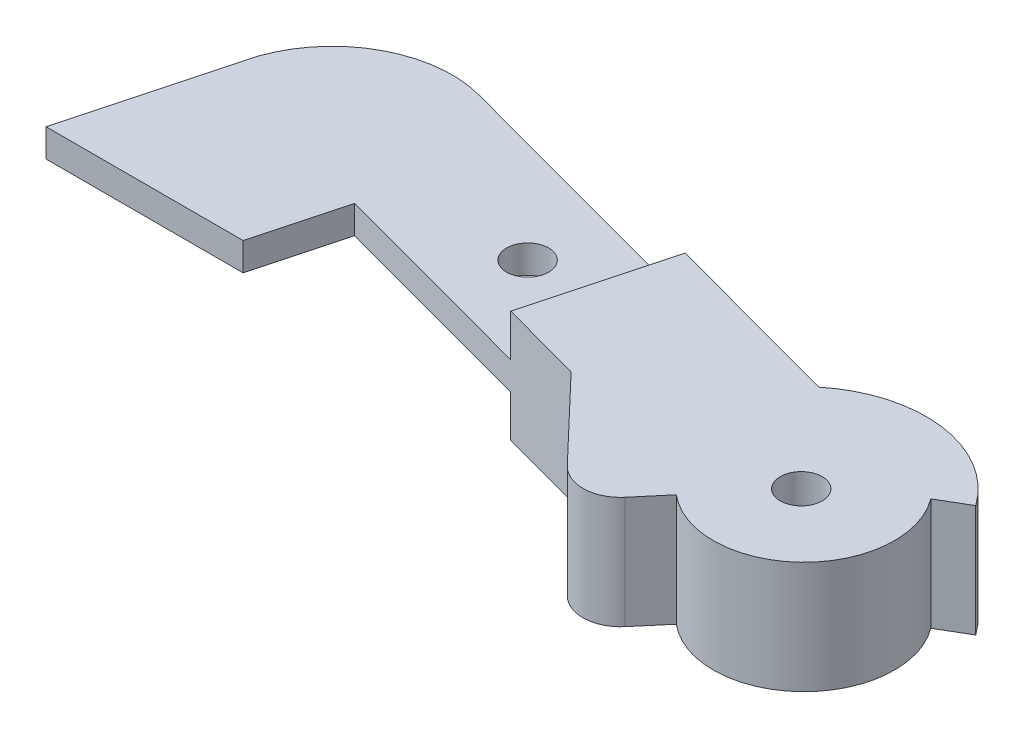
ISO-10303-21;
HEADER;
FILE_DESCRIPTION(('STEP AP214'),'2;1');
FILE_NAME('part.step','',(''),(''),'','','');
FILE_SCHEMA(('AUTOMOTIVE_DESIGN { 1 0 10303 214 1 1 1 1 }'));
ENDSEC;
DATA;
#1=APPLICATION_CONTEXT('core data for automotive mechanical design processes');
#2=APPLICATION_PROTOCOL_DEFINITION('international standard','automotive_design',2000,#1);
#3=PRODUCT_CONTEXT('',#1,'mechanical');
#4=PRODUCT('Part','Part','',(#3));
#5=PRODUCT_RELATED_PRODUCT_CATEGORY('part','',(#4));
#6=PRODUCT_DEFINITION_FORMATION('','',#4);
#7=PRODUCT_DEFINITION_CONTEXT('part definition',#1,'design');
#8=PRODUCT_DEFINITION('design','',#6,#7);
#9=PRODUCT_DEFINITION_SHAPE('','',#8);
#10=(LENGTH_UNIT() NAMED_UNIT(*) SI_UNIT(.MILLI.,.METRE.));
#11=(NAMED_UNIT(*) PLANE_ANGLE_UNIT() SI_UNIT($,.RADIAN.));
#12=(NAMED_UNIT(*) SI_UNIT($,.STERADIAN.) SOLID_ANGLE_UNIT());
#13=UNCERTAINTY_MEASURE_WITH_UNIT(LENGTH_MEASURE(1.E-05),#10,'distance_accuracy_value','');
#14=(GEOMETRIC_REPRESENTATION_CONTEXT(3) GLOBAL_UNCERTAINTY_ASSIGNED_CONTEXT((#13)) GLOBAL_UNIT_ASSIGNED_CONTEXT((#10,
#11,#12)) REPRESENTATION_CONTEXT('',''));
#15=CARTESIAN_POINT('',(0.,0.,0.));
#16=DIRECTION('',(0.,0.,1.));
#17=DIRECTION('',(1.,0.,0.));
#18=AXIS2_PLACEMENT_3D('',#15,#16,#17);
#19=CARTESIAN_POINT('',(0.,3.,0.));
#20=DIRECTION('',(0.,1.,0.));
#21=DIRECTION('',(0.,0.,1.));
#22=AXIS2_PLACEMENT_3D('',#19,#20,#21);
#23=PLANE('',#22);
#24=CARTESIAN_POINT('',(38.1375473411404,3.,-13.414423288289));
#25=DIRECTION('',(0.,1.,0.));
#26=DIRECTION('',(0.,0.,1.));
#27=AXIS2_PLACEMENT_3D('',#24,#25,#26);
#28=CIRCLE('',#27,2.25);
#29=CARTESIAN_POINT('',(38.1375473411404,3.,-11.164423288289));
#30=VERTEX_POINT('',#29);
#31=EDGE_CURVE('E263',#30,#30,#28,.T.);
#32=ORIENTED_EDGE('',*,*,#31,.F.);
#33=EDGE_LOOP('',(#32));
#34=FACE_BOUND('',#33,.T.);
#35=DIRECTION('',(0.965802034417138,0.,0.259280601502922));
#36=VECTOR('',#35,1.);
#37=CARTESIAN_POINT('',(3.94302267334463,3.,-14.6874825867998));
#38=LINE('',#37,#36);
#39=CARTESIAN_POINT('',(23.6218770970386,3.,-9.40446906017879));
#40=VERTEX_POINT('',#39);
#41=CARTESIAN_POINT('',(46.4667869024904,3.,-3.27149175783521));
#42=VERTEX_POINT('',#41);
#43=EDGE_CURVE('E191',#40,#42,#38,.T.);
#44=ORIENTED_EDGE('',*,*,#43,.T.);
#45=DIRECTION('',(0.259777797376157,0.,-0.965668419277752));
#46=VECTOR('',#45,1.);
#47=CARTESIAN_POINT('',(46.4667869024904,3.,-3.27149175783521));
#48=LINE('',#47,#46);
#49=CARTESIAN_POINT('',(50.4273284390443,3.,-17.9939581260828));
#50=VERTEX_POINT('',#49);
#51=EDGE_CURVE('E234',#42,#50,#48,.T.);
#52=ORIENTED_EDGE('',*,*,#51,.T.);
#53=DIRECTION('',(-0.965668419277752,0.,-0.259777797376157));
#54=VECTOR('',#53,1.);
#55=CARTESIAN_POINT('',(7.9170134576932,3.,-29.4298048113059));
#56=LINE('',#55,#54);
#57=CARTESIAN_POINT('',(20.2817959844678,3.,-26.1035119495769));
#58=VERTEX_POINT('',#57);
#59=EDGE_CURVE('E266',#50,#58,#56,.T.);
#60=ORIENTED_EDGE('',*,*,#59,.T.);
#61=CARTESIAN_POINT('',(16.9456022551539,3.,-13.7019250644362));
#62=DIRECTION('',(0.,1.,0.));
#63=DIRECTION('',(0.,0.,1.));
#64=AXIS2_PLACEMENT_3D('',#61,#62,#63);
#65=CIRCLE('',#64,12.8424898625309);
#66=CARTESIAN_POINT('',(4.79412868436272,3.,-17.8577927148279));
#67=VERTEX_POINT('',#66);
#68=EDGE_CURVE('E269',#58,#67,#65,.T.);
#69=ORIENTED_EDGE('',*,*,#68,.T.);
#70=DIRECTION('',(0.259280601502922,0.,-0.965802034417138));
#71=VECTOR('',#70,1.);
#72=CARTESIAN_POINT('',(0.,3.,0.));
#73=LINE('',#72,#71);
#74=CARTESIAN_POINT('',(0.,3.,0.));
#75=VERTEX_POINT('',#74);
#76=EDGE_CURVE('E271',#75,#67,#73,.T.);
#77=ORIENTED_EDGE('',*,*,#76,.F.);
#78=DIRECTION('',(1.,0.,0.));
#79=VECTOR('',#78,1.);
#80=CARTESIAN_POINT('',(0.,3.,0.));
#81=LINE('',#80,#79);
#82=CARTESIAN_POINT('',(21.0971398239282,3.,0.));
#83=VERTEX_POINT('',#82);
#84=EDGE_CURVE('E274',#75,#83,#81,.T.);
#85=ORIENTED_EDGE('',*,*,#84,.T.);
#86=DIRECTION('',(0.259280601502922,0.,-0.965802034417138));
#87=VECTOR('',#86,1.);
#88=CARTESIAN_POINT('',(19.6788544236939,3.,5.28301352662098));
#89=LINE('',#88,#87);
#90=EDGE_CURVE('E276',#83,#40,#89,.T.);
#91=ORIENTED_EDGE('',*,*,#90,.T.);
#92=EDGE_LOOP('',(#44,#52,#60,#69,#77,#85,#91));
#93=FACE_BOUND('',#92,.T.);
#94=ADVANCED_FACE('F65',(#34,#93),#23,.T.);
#95=CARTESIAN_POINT('',(7.9170134576932,3.,-29.4298048113059));
#96=DIRECTION('',(-0.259777797376157,0.,0.965668419277752));
#97=DIRECTION('',(0.965668419277752,0.,0.259777797376157));
#98=AXIS2_PLACEMENT_3D('',#95,#96,#97);
#99=PLANE('',#98);
#100=DIRECTION('',(0.,-1.,0.));
#101=VECTOR('',#100,1.);
#102=CARTESIAN_POINT('',(70.0120906436634,3.,-12.725393589762));
#103=LINE('',#102,#101);
#104=CARTESIAN_POINT('',(70.0120906436634,7.5,-12.725393589762));
#105=VERTEX_POINT('',#104);
#106=CARTESIAN_POINT('',(70.0120906436634,-4.5,-12.725393589762));
#107=VERTEX_POINT('',#106);
#108=EDGE_CURVE('E181',#105,#107,#103,.T.);
#109=ORIENTED_EDGE('',*,*,#108,.T.);
#110=DIRECTION('',(-0.965668419277752,0.,-0.259777797376158));
#111=VECTOR('',#110,1.);
#112=CARTESIAN_POINT('',(7.9170134576932,-4.5,-29.4298048113059));
#113=LINE('',#112,#111);
#114=CARTESIAN_POINT('',(50.4273284390443,-4.5,-17.9939581260828));
#115=VERTEX_POINT('',#114);
#116=EDGE_CURVE('E184',#107,#115,#113,.T.);
#117=ORIENTED_EDGE('',*,*,#116,.T.);
#118=DIRECTION('',(0.,1.,0.));
#119=VECTOR('',#118,1.);
#120=CARTESIAN_POINT('',(50.4273284390443,-4.5,-17.9939581260828));
#121=LINE('',#120,#119);
#122=CARTESIAN_POINT('',(50.4273284390443,0.,-17.9939581260828));
#123=VERTEX_POINT('',#122);
#124=EDGE_CURVE('E227',#115,#123,#121,.T.);
#125=ORIENTED_EDGE('',*,*,#124,.T.);
#126=DIRECTION('',(-0.965668419277752,0.,-0.259777797376157));
#127=VECTOR('',#126,1.);
#128=CARTESIAN_POINT('',(7.9170134576932,0.,-29.4298048113059));
#129=LINE('',#128,#127);
#130=CARTESIAN_POINT('',(20.2817959844678,0.,-26.1035119495769));
#131=VERTEX_POINT('',#130);
#132=EDGE_CURVE('E282',#123,#131,#129,.T.);
#133=ORIENTED_EDGE('',*,*,#132,.T.);
#134=DIRECTION('',(0.,-1.,0.));
#135=VECTOR('',#134,1.);
#136=CARTESIAN_POINT('',(20.2817959844678,3.,-26.1035119495769));
#137=LINE('',#136,#135);
#138=EDGE_CURVE('E12',#58,#131,#137,.T.);
#139=ORIENTED_EDGE('',*,*,#138,.F.);
#140=ORIENTED_EDGE('',*,*,#59,.F.);
#141=DIRECTION('',(0.,-1.,0.));
#142=VECTOR('',#141,1.);
#143=CARTESIAN_POINT('',(50.4273284390443,7.5,-17.9939581260828));
#144=LINE('',#143,#142);
#145=CARTESIAN_POINT('',(50.4273284390443,7.5,-17.9939581260828));
#146=VERTEX_POINT('',#145);
#147=EDGE_CURVE('E88',#146,#50,#144,.T.);
#148=ORIENTED_EDGE('',*,*,#147,.F.);
#149=DIRECTION('',(-0.965668419277752,0.,-0.259777797376158));
#150=VECTOR('',#149,1.);
#151=CARTESIAN_POINT('',(70.0120906436634,7.5,-12.725393589762));
#152=LINE('',#151,#150);
#153=EDGE_CURVE('E185',#105,#146,#152,.T.);
#154=ORIENTED_EDGE('',*,*,#153,.F.);
#155=EDGE_LOOP('',(#109,#117,#125,#133,#139,#140,#148,#154));
#156=FACE_BOUND('',#155,.T.);
#157=ADVANCED_FACE('F183',(#156),#99,.F.);
#158=CARTESIAN_POINT('',(16.9456022551539,3.,-13.7019250644362));
#159=DIRECTION('',(0.,-1.,0.));
#160=DIRECTION('',(0.,0.,-1.));
#161=AXIS2_PLACEMENT_3D('',#158,#159,#160);
#162=CYLINDRICAL_SURFACE('',#161,12.8424898625309);
#163=CARTESIAN_POINT('',(16.9456022551539,0.,-13.7019250644362));
#164=DIRECTION('',(0.,1.,0.));
#165=DIRECTION('',(0.,0.,1.));
#166=AXIS2_PLACEMENT_3D('',#163,#164,#165);
#167=CIRCLE('',#166,12.8424898625309);
#168=CARTESIAN_POINT('',(4.79412868436272,0.,-17.8577927148279));
#169=VERTEX_POINT('',#168);
#170=EDGE_CURVE('E284',#131,#169,#167,.T.);
#171=ORIENTED_EDGE('',*,*,#170,.T.);
#172=DIRECTION('',(0.,-1.,0.));
#173=VECTOR('',#172,1.);
#174=CARTESIAN_POINT('',(4.79412868436272,3.,-17.8577927148279));
#175=LINE('',#174,#173);
#176=EDGE_CURVE('E73',#67,#169,#175,.T.);
#177=ORIENTED_EDGE('',*,*,#176,.F.);
#178=ORIENTED_EDGE('',*,*,#68,.F.);
#179=ORIENTED_EDGE('',*,*,#138,.T.);
#180=EDGE_LOOP('',(#171,#177,#178,#179));
#181=FACE_BOUND('',#180,.T.);
#182=ADVANCED_FACE('F322',(#181),#162,.T.);
#183=CARTESIAN_POINT('',(0.,3.,0.));
#184=DIRECTION('',(-0.965802034417138,0.,-0.259280601502922));
#185=DIRECTION('',(-0.259280601502922,0.,0.965802034417138));
#186=AXIS2_PLACEMENT_3D('',#183,#184,#185);
#187=PLANE('',#186);
#188=DIRECTION('',(0.259280601502922,0.,-0.965802034417138));
#189=VECTOR('',#188,1.);
#190=CARTESIAN_POINT('',(0.,0.,0.));
#191=LINE('',#190,#189);
#192=CARTESIAN_POINT('',(0.,0.,0.));
#193=VERTEX_POINT('',#192);
#194=EDGE_CURVE('E287',#193,#169,#191,.T.);
#195=ORIENTED_EDGE('',*,*,#194,.F.);
#196=DIRECTION('',(0.,-1.,0.));
#197=VECTOR('',#196,1.);
#198=CARTESIAN_POINT('',(0.,3.,0.));
#199=LINE('',#198,#197);
#200=EDGE_CURVE('E313',#75,#193,#199,.T.);
#201=ORIENTED_EDGE('',*,*,#200,.F.);
#202=ORIENTED_EDGE('',*,*,#76,.T.);
#203=ORIENTED_EDGE('',*,*,#176,.T.);
#204=EDGE_LOOP('',(#195,#201,#202,#203));
#205=FACE_BOUND('',#204,.T.);
#206=ADVANCED_FACE('F317',(#205),#187,.T.);
#207=CARTESIAN_POINT('',(0.,3.,0.));
#208=DIRECTION('',(0.,0.,-1.));
#209=DIRECTION('',(-1.,0.,0.));
#210=AXIS2_PLACEMENT_3D('',#207,#208,#209);
#211=PLANE('',#210);
#212=DIRECTION('',(1.,0.,0.));
#213=VECTOR('',#212,1.);
#214=CARTESIAN_POINT('',(0.,0.,0.));
#215=LINE('',#214,#213);
#216=CARTESIAN_POINT('',(21.0971398239282,0.,0.));
#217=VERTEX_POINT('',#216);
#218=EDGE_CURVE('E290',#193,#217,#215,.T.);
#219=ORIENTED_EDGE('',*,*,#218,.T.);
#220=DIRECTION('',(0.,-1.,0.));
#221=VECTOR('',#220,1.);
#222=CARTESIAN_POINT('',(21.0971398239282,3.,0.));
#223=LINE('',#222,#221);
#224=EDGE_CURVE('E310',#83,#217,#223,.T.);
#225=ORIENTED_EDGE('',*,*,#224,.F.);
#226=ORIENTED_EDGE('',*,*,#84,.F.);
#227=ORIENTED_EDGE('',*,*,#200,.T.);
#228=EDGE_LOOP('',(#219,#225,#226,#227));
#229=FACE_BOUND('',#228,.T.);
#230=ADVANCED_FACE('F332',(#229),#211,.F.);
#231=CARTESIAN_POINT('',(19.6788544236939,3.,5.28301352662098));
#232=DIRECTION('',(-0.965802034417138,0.,-0.259280601502922));
#233=DIRECTION('',(-0.259280601502922,0.,0.965802034417138));
#234=AXIS2_PLACEMENT_3D('',#231,#232,#233);
#235=PLANE('',#234);
#236=DIRECTION('',(0.259280601502922,0.,-0.965802034417138));
#237=VECTOR('',#236,1.);
#238=CARTESIAN_POINT('',(19.6788544236939,0.,5.28301352662098));
#239=LINE('',#238,#237);
#240=CARTESIAN_POINT('',(23.6218770970386,0.,-9.40446906017879));
#241=VERTEX_POINT('',#240);
#242=EDGE_CURVE('E292',#217,#241,#239,.T.);
#243=ORIENTED_EDGE('',*,*,#242,.T.);
#244=DIRECTION('',(0.,-1.,0.));
#245=VECTOR('',#244,1.);
#246=CARTESIAN_POINT('',(23.6218770970386,3.,-9.40446906017879));
#247=LINE('',#246,#245);
#248=EDGE_CURVE('E307',#40,#241,#247,.T.);
#249=ORIENTED_EDGE('',*,*,#248,.F.);
#250=ORIENTED_EDGE('',*,*,#90,.F.);
#251=ORIENTED_EDGE('',*,*,#224,.T.);
#252=EDGE_LOOP('',(#243,#249,#250,#251));
#253=FACE_BOUND('',#252,.T.);
#254=ADVANCED_FACE('F336',(#253),#235,.F.);
#255=CARTESIAN_POINT('',(3.94302267334463,3.,-14.6874825867998));
#256=DIRECTION('',(0.259280601502922,0.,-0.965802034417138));
#257=DIRECTION('',(-0.965802034417138,0.,-0.259280601502922));
#258=AXIS2_PLACEMENT_3D('',#255,#256,#257);
#259=PLANE('',#258);
#260=DIRECTION('',(0.965802034417138,0.,0.259280601502922));
#261=VECTOR('',#260,1.);
#262=CARTESIAN_POINT('',(3.94302267334463,0.,-14.6874825867998));
#263=LINE('',#262,#261);
#264=CARTESIAN_POINT('',(46.4667869024904,0.,-3.27149175783521));
#265=VERTEX_POINT('',#264);
#266=EDGE_CURVE('E267',#241,#265,#263,.T.);
#267=ORIENTED_EDGE('',*,*,#266,.T.);
#268=DIRECTION('',(0.,1.,0.));
#269=VECTOR('',#268,1.);
#270=CARTESIAN_POINT('',(46.4667869024904,-4.5,-3.27149175783521));
#271=LINE('',#270,#269);
#272=CARTESIAN_POINT('',(46.4667869024904,-4.5,-3.27149175783521));
#273=VERTEX_POINT('',#272);
#274=EDGE_CURVE('E80',#273,#265,#271,.T.);
#275=ORIENTED_EDGE('',*,*,#274,.F.);
#276=DIRECTION('',(0.965802034417138,0.,0.259280601502922));
#277=VECTOR('',#276,1.);
#278=CARTESIAN_POINT('',(3.94302267334463,-4.5,-14.6874825867998));
#279=LINE('',#278,#277);
#280=CARTESIAN_POINT('',(55.3156360705464,-4.5,-0.895916999094068));
#281=VERTEX_POINT('',#280);
#282=EDGE_CURVE('E211',#273,#281,#279,.T.);
#283=ORIENTED_EDGE('',*,*,#282,.T.);
#284=DIRECTION('',(0.,-1.,0.));
#285=VECTOR('',#284,1.);
#286=CARTESIAN_POINT('',(55.3156360705464,3.,-0.895916999094084));
#287=LINE('',#286,#285);
#288=CARTESIAN_POINT('',(55.3156360705464,7.5,-0.895916999094082));
#289=VERTEX_POINT('',#288);
#290=EDGE_CURVE('E305',#289,#281,#287,.T.);
#291=ORIENTED_EDGE('',*,*,#290,.F.);
#292=DIRECTION('',(0.965802034417138,0.,0.259280601502922));
#293=VECTOR('',#292,1.);
#294=CARTESIAN_POINT('',(46.4667869024904,7.5,-3.27149175783521));
#295=LINE('',#294,#293);
#296=CARTESIAN_POINT('',(46.4667869024904,7.5,-3.27149175783521));
#297=VERTEX_POINT('',#296);
#298=EDGE_CURVE('E255',#297,#289,#295,.T.);
#299=ORIENTED_EDGE('',*,*,#298,.F.);
#300=DIRECTION('',(0.,-1.,0.));
#301=VECTOR('',#300,1.);
#302=CARTESIAN_POINT('',(46.4667869024904,7.5,-3.27149175783521));
#303=LINE('',#302,#301);
#304=EDGE_CURVE('E259',#297,#42,#303,.T.);
#305=ORIENTED_EDGE('',*,*,#304,.T.);
#306=ORIENTED_EDGE('',*,*,#43,.F.);
#307=ORIENTED_EDGE('',*,*,#248,.T.);
#308=EDGE_LOOP('',(#267,#275,#283,#291,#299,#305,#306,#307));
#309=FACE_BOUND('',#308,.T.);
#310=ADVANCED_FACE('F342',(#309),#259,.F.);
#311=CARTESIAN_POINT('',(29.4129100361565,3.,-28.0536683683049));
#312=DIRECTION('',(0.72362939989931,0.,-0.690188736217394));
#313=DIRECTION('',(-0.690188736217394,0.,-0.72362939989931));
#314=AXIS2_PLACEMENT_3D('',#311,#312,#313);
#315=PLANE('',#314);
#316=ORIENTED_EDGE('',*,*,#290,.T.);
#317=DIRECTION('',(0.690188736217395,0.,0.72362939989931));
#318=VECTOR('',#317,1.);
#319=CARTESIAN_POINT('',(29.4129100361564,-4.5,-28.0536683683049));
#320=LINE('',#319,#318);
#321=CARTESIAN_POINT('',(63.8376796319956,-4.5,8.03903216000791));
#322=VERTEX_POINT('',#321);
#323=EDGE_CURVE('E214',#281,#322,#320,.T.);
#324=ORIENTED_EDGE('',*,*,#323,.T.);
#325=DIRECTION('',(0.,-1.,0.));
#326=VECTOR('',#325,1.);
#327=CARTESIAN_POINT('',(63.8376796319956,3.,8.0390321600079));
#328=LINE('',#327,#326);
#329=CARTESIAN_POINT('',(63.8376796319956,7.5,8.0390321600079));
#330=VERTEX_POINT('',#329);
#331=EDGE_CURVE('E303',#330,#322,#328,.T.);
#332=ORIENTED_EDGE('',*,*,#331,.F.);
#333=DIRECTION('',(0.690188736217395,0.,0.72362939989931));
#334=VECTOR('',#333,1.);
#335=CARTESIAN_POINT('',(55.3156360705464,7.5,-0.895916999094082));
#336=LINE('',#335,#334);
#337=EDGE_CURVE('E252',#289,#330,#336,.T.);
#338=ORIENTED_EDGE('',*,*,#337,.F.);
#339=EDGE_LOOP('',(#316,#324,#332,#338));
#340=FACE_BOUND('',#339,.T.);
#341=ADVANCED_FACE('F387',(#340),#315,.F.);
#342=CARTESIAN_POINT('',(66.757905074769,3.,5.25375739353469));
#343=DIRECTION('',(0.,-1.,0.));
#344=DIRECTION('',(0.,0.,-1.));
#345=AXIS2_PLACEMENT_3D('',#342,#343,#344);
#346=CYLINDRICAL_SURFACE('',#345,4.03552625581521);
#347=ORIENTED_EDGE('',*,*,#331,.T.);
#348=CARTESIAN_POINT('',(66.757905074769,-4.5,5.25375739353469));
#349=DIRECTION('',(0.,1.,0.));
#350=DIRECTION('',(0.,0.,1.));
#351=AXIS2_PLACEMENT_3D('',#348,#349,#350);
#352=CIRCLE('',#351,4.03552625581521);
#353=CARTESIAN_POINT('',(69.8379967156942,-4.5,7.86115219388176));
#354=VERTEX_POINT('',#353);
#355=EDGE_CURVE('E217',#322,#354,#352,.T.);
#356=ORIENTED_EDGE('',*,*,#355,.T.);
#357=DIRECTION('',(0.,-1.,0.));
#358=VECTOR('',#357,1.);
#359=CARTESIAN_POINT('',(69.8379967156942,3.,7.86115219388177));
#360=LINE('',#359,#358);
#361=CARTESIAN_POINT('',(69.8379967156942,7.5,7.86115219388176));
#362=VERTEX_POINT('',#361);
#363=EDGE_CURVE('E301',#362,#354,#360,.T.);
#364=ORIENTED_EDGE('',*,*,#363,.F.);
#365=CARTESIAN_POINT('',(66.757905074769,7.5,5.25375739353469));
#366=DIRECTION('',(0.,1.,0.));
#367=DIRECTION('',(0.,0.,1.));
#368=AXIS2_PLACEMENT_3D('',#365,#366,#367);
#369=CIRCLE('',#368,4.03552625581521);
#370=EDGE_CURVE('E249',#330,#362,#369,.T.);
#371=ORIENTED_EDGE('',*,*,#370,.F.);
#372=EDGE_LOOP('',(#347,#356,#364,#371));
#373=FACE_BOUND('',#372,.T.);
#374=ADVANCED_FACE('F383',(#373),#346,.T.);
#375=CARTESIAN_POINT('',(44.5601834680311,3.,37.7216018943377));
#376=DIRECTION('',(0.763244108866031,0.,0.646110230751146));
#377=DIRECTION('',(0.646110230751146,0.,-0.763244108866031));
#378=AXIS2_PLACEMENT_3D('',#375,#376,#377);
#379=PLANE('',#378);
#380=ORIENTED_EDGE('',*,*,#363,.T.);
#381=DIRECTION('',(0.646110230751145,0.,-0.763244108866031));
#382=VECTOR('',#381,1.);
#383=CARTESIAN_POINT('',(44.5601834680311,-4.5,37.7216018943377));
#384=LINE('',#383,#382);
#385=CARTESIAN_POINT('',(72.3541391992329,-4.5,4.8888560805764));
#386=VERTEX_POINT('',#385);
#387=EDGE_CURVE('E220',#354,#386,#384,.T.);
#388=ORIENTED_EDGE('',*,*,#387,.T.);
#389=DIRECTION('',(0.,-1.,0.));
#390=VECTOR('',#389,1.);
#391=CARTESIAN_POINT('',(72.3541391992329,3.,4.8888560805764));
#392=LINE('',#391,#390);
#393=CARTESIAN_POINT('',(72.3541391992329,7.5,4.8888560805764));
#394=VERTEX_POINT('',#393);
#395=EDGE_CURVE('E299',#394,#386,#392,.T.);
#396=ORIENTED_EDGE('',*,*,#395,.F.);
#397=DIRECTION('',(-0.646110230751145,0.,0.763244108866031));
#398=VECTOR('',#397,1.);
#399=CARTESIAN_POINT('',(72.3541391992329,7.5,4.8888560805764));
#400=LINE('',#399,#398);
#401=EDGE_CURVE('E246',#394,#362,#400,.T.);
#402=ORIENTED_EDGE('',*,*,#401,.T.);
#403=EDGE_LOOP('',(#380,#388,#396,#402));
#404=FACE_BOUND('',#403,.T.);
#405=ADVANCED_FACE('F379',(#404),#379,.T.);
#406=CARTESIAN_POINT('',(78.5875808392102,3.,-2.54414840176175));
#407=DIRECTION('',(0.,-1.,0.));
#408=DIRECTION('',(0.,0.,-1.));
#409=AXIS2_PLACEMENT_3D('',#406,#407,#408);
#410=CYLINDRICAL_SURFACE('',#409,9.70079122100164);
#411=ORIENTED_EDGE('',*,*,#395,.T.);
#412=CARTESIAN_POINT('',(78.5875808392102,-4.5,-2.54414840176176));
#413=DIRECTION('',(0.,1.,0.));
#414=DIRECTION('',(0.,0.,1.));
#415=AXIS2_PLACEMENT_3D('',#412,#413,#414);
#416=CIRCLE('',#415,9.70079122100164);
#417=CARTESIAN_POINT('',(86.3532864945731,-4.5,-8.3578534155828));
#418=VERTEX_POINT('',#417);
#419=EDGE_CURVE('E223',#386,#418,#416,.T.);
#420=ORIENTED_EDGE('',*,*,#419,.T.);
#421=DIRECTION('',(0.,-1.,0.));
#422=VECTOR('',#421,1.);
#423=CARTESIAN_POINT('',(86.3532864945731,3.,-8.3578534155828));
#424=LINE('',#423,#422);
#425=CARTESIAN_POINT('',(86.3532864945731,7.5,-8.3578534155828));
#426=VERTEX_POINT('',#425);
#427=EDGE_CURVE('E297',#426,#418,#424,.T.);
#428=ORIENTED_EDGE('',*,*,#427,.F.);
#429=CARTESIAN_POINT('',(78.5875808392102,7.5,-2.54414840176176));
#430=DIRECTION('',(0.,1.,0.));
#431=DIRECTION('',(0.,0.,1.));
#432=AXIS2_PLACEMENT_3D('',#429,#430,#431);
#433=CIRCLE('',#432,9.70079122100164);
#434=EDGE_CURVE('E243',#394,#426,#433,.T.);
#435=ORIENTED_EDGE('',*,*,#434,.F.);
#436=EDGE_LOOP('',(#411,#420,#428,#435));
#437=FACE_BOUND('',#436,.T.);
#438=ADVANCED_FACE('F375',(#437),#410,.T.);
#439=CARTESIAN_POINT('',(18.453197851153,3.,31.4642661665422));
#440=DIRECTION('',(0.505895532026137,0.,0.862594754607279));
#441=DIRECTION('',(0.862594754607279,0.,-0.505895532026137));
#442=AXIS2_PLACEMENT_3D('',#439,#440,#441);
#443=PLANE('',#442);
#444=ORIENTED_EDGE('',*,*,#427,.T.);
#445=DIRECTION('',(0.862594754607279,0.,-0.505895532026138));
#446=VECTOR('',#445,1.);
#447=CARTESIAN_POINT('',(18.4531978511531,-4.5,31.4642661665423));
#448=LINE('',#447,#446);
#449=CARTESIAN_POINT('',(89.3835009315383,-4.5,-10.1350169521727));
#450=VERTEX_POINT('',#449);
#451=EDGE_CURVE('E226',#418,#450,#448,.T.);
#452=ORIENTED_EDGE('',*,*,#451,.T.);
#453=DIRECTION('',(0.,-1.,0.));
#454=VECTOR('',#453,1.);
#455=CARTESIAN_POINT('',(89.3835009315383,3.,-10.1350169521727));
#456=LINE('',#455,#454);
#457=CARTESIAN_POINT('',(89.3835009315383,7.5,-10.1350169521727));
#458=VERTEX_POINT('',#457);
#459=EDGE_CURVE('E190',#458,#450,#456,.T.);
#460=ORIENTED_EDGE('',*,*,#459,.F.);
#461=DIRECTION('',(-0.862594754607279,0.,0.505895532026138));
#462=VECTOR('',#461,1.);
#463=CARTESIAN_POINT('',(89.3835009315383,7.5,-10.1350169521727));
#464=LINE('',#463,#462);
#465=EDGE_CURVE('E240',#458,#426,#464,.T.);
#466=ORIENTED_EDGE('',*,*,#465,.T.);
#467=EDGE_LOOP('',(#444,#452,#460,#466));
#468=FACE_BOUND('',#467,.T.);
#469=ADVANCED_FACE('F371',(#468),#443,.T.);
#470=CARTESIAN_POINT('',(78.4844476153933,3.,-2.3565188715452));
#471=DIRECTION('',(0.,-1.,0.));
#472=DIRECTION('',(0.,0.,-1.));
#473=AXIS2_PLACEMENT_3D('',#470,#471,#472);
#474=CYLINDRICAL_SURFACE('',#473,2.25);
#475=CARTESIAN_POINT('',(78.4844476153933,7.5,-2.3565188715452));
#476=DIRECTION('',(0.,1.,0.));
#477=DIRECTION('',(0.,0.,1.));
#478=AXIS2_PLACEMENT_3D('',#475,#476,#477);
#479=CIRCLE('',#478,2.25);
#480=CARTESIAN_POINT('',(78.4844476153933,7.5,-0.106518871545203));
#481=VERTEX_POINT('',#480);
#482=EDGE_CURVE('E230',#481,#481,#479,.T.);
#483=ORIENTED_EDGE('',*,*,#482,.T.);
#484=EDGE_LOOP('',(#483));
#485=FACE_BOUND('',#484,.T.);
#486=CARTESIAN_POINT('',(78.4844476153933,-4.5,-2.3565188715452));
#487=DIRECTION('',(0.,1.,0.));
#488=DIRECTION('',(0.,0.,1.));
#489=AXIS2_PLACEMENT_3D('',#486,#487,#488);
#490=CIRCLE('',#489,2.25);
#491=CARTESIAN_POINT('',(78.4844476153933,-4.5,-0.106518871545203));
#492=VERTEX_POINT('',#491);
#493=EDGE_CURVE('E206',#492,#492,#490,.T.);
#494=ORIENTED_EDGE('',*,*,#493,.F.);
#495=EDGE_LOOP('',(#494));
#496=FACE_BOUND('',#495,.T.);
#497=ADVANCED_FACE('F374',(#485,#496),#474,.F.);
#498=CARTESIAN_POINT('',(38.1375473411404,3.,-13.414423288289));
#499=DIRECTION('',(0.,-1.,0.));
#500=DIRECTION('',(0.,0.,-1.));
#501=AXIS2_PLACEMENT_3D('',#498,#499,#500);
#502=CYLINDRICAL_SURFACE('',#501,2.25);
#503=ORIENTED_EDGE('',*,*,#31,.T.);
#504=EDGE_LOOP('',(#503));
#505=FACE_BOUND('',#504,.T.);
#506=CARTESIAN_POINT('',(38.1375473411404,0.,-13.414423288289));
#507=DIRECTION('',(0.,1.,0.));
#508=DIRECTION('',(0.,0.,1.));
#509=AXIS2_PLACEMENT_3D('',#506,#507,#508);
#510=CIRCLE('',#509,2.25);
#511=CARTESIAN_POINT('',(38.1375473411404,0.,-11.164423288289));
#512=VERTEX_POINT('',#511);
#513=EDGE_CURVE('E261',#512,#512,#510,.T.);
#514=ORIENTED_EDGE('',*,*,#513,.F.);
#515=EDGE_LOOP('',(#514));
#516=FACE_BOUND('',#515,.T.);
#517=ADVANCED_FACE('F67',(#505,#516),#502,.F.);
#518=CARTESIAN_POINT('',(78.4844476153933,3.,-2.3565188715452));
#519=DIRECTION('',(0.,-1.,0.));
#520=DIRECTION('',(0.,0.,-1.));
#521=AXIS2_PLACEMENT_3D('',#518,#519,#520);
#522=CYLINDRICAL_SURFACE('',#521,13.3900857196097);
#523=ORIENTED_EDGE('',*,*,#459,.T.);
#524=CARTESIAN_POINT('',(78.4844476153933,-4.5,-2.3565188715452));
#525=DIRECTION('',(0.,1.,0.));
#526=DIRECTION('',(0.,0.,1.));
#527=AXIS2_PLACEMENT_3D('',#524,#525,#526);
#528=CIRCLE('',#527,13.3900857196097);
#529=EDGE_CURVE('E198',#450,#107,#528,.T.);
#530=ORIENTED_EDGE('',*,*,#529,.T.);
#531=ORIENTED_EDGE('',*,*,#108,.F.);
#532=CARTESIAN_POINT('',(78.4844476153933,7.5,-2.3565188715452));
#533=DIRECTION('',(0.,1.,0.));
#534=DIRECTION('',(0.,0.,1.));
#535=AXIS2_PLACEMENT_3D('',#532,#533,#534);
#536=CIRCLE('',#535,13.3900857196097);
#537=EDGE_CURVE('E238',#458,#105,#536,.T.);
#538=ORIENTED_EDGE('',*,*,#537,.F.);
#539=EDGE_LOOP('',(#523,#530,#531,#538));
#540=FACE_BOUND('',#539,.T.);
#541=ADVANCED_FACE('F203',(#540),#522,.T.);
#542=CARTESIAN_POINT('',(0.,0.,0.));
#543=DIRECTION('',(0.,1.,0.));
#544=DIRECTION('',(0.,0.,1.));
#545=AXIS2_PLACEMENT_3D('',#542,#543,#544);
#546=PLANE('',#545);
#547=ORIENTED_EDGE('',*,*,#513,.T.);
#548=EDGE_LOOP('',(#547));
#549=FACE_BOUND('',#548,.T.);
#550=ORIENTED_EDGE('',*,*,#132,.F.);
#551=DIRECTION('',(-0.259777797376157,0.,0.965668419277752));
#552=VECTOR('',#551,1.);
#553=CARTESIAN_POINT('',(42.5103149813511,0.,11.4358466852231));
#554=LINE('',#553,#552);
#555=EDGE_CURVE('E204',#123,#265,#554,.T.);
#556=ORIENTED_EDGE('',*,*,#555,.T.);
#557=ORIENTED_EDGE('',*,*,#266,.F.);
#558=ORIENTED_EDGE('',*,*,#242,.F.);
#559=ORIENTED_EDGE('',*,*,#218,.F.);
#560=ORIENTED_EDGE('',*,*,#194,.T.);
#561=ORIENTED_EDGE('',*,*,#170,.F.);
#562=EDGE_LOOP('',(#550,#556,#557,#558,#559,#560,#561));
#563=FACE_BOUND('',#562,.T.);
#564=ADVANCED_FACE('F327',(#549,#563),#546,.F.);
#565=CARTESIAN_POINT('',(78.4844476153933,7.5,-2.3565188715452));
#566=DIRECTION('',(0.,1.,0.));
#567=DIRECTION('',(0.,0.,1.));
#568=AXIS2_PLACEMENT_3D('',#565,#566,#567);
#569=PLANE('',#568);
#570=DIRECTION('',(0.259777797376157,0.,-0.965668419277752));
#571=VECTOR('',#570,1.);
#572=CARTESIAN_POINT('',(46.4667869024904,7.5,-3.27149175783521));
#573=LINE('',#572,#571);
#574=EDGE_CURVE('E235',#297,#146,#573,.T.);
#575=ORIENTED_EDGE('',*,*,#574,.F.);
#576=ORIENTED_EDGE('',*,*,#298,.T.);
#577=ORIENTED_EDGE('',*,*,#337,.T.);
#578=ORIENTED_EDGE('',*,*,#370,.T.);
#579=ORIENTED_EDGE('',*,*,#401,.F.);
#580=ORIENTED_EDGE('',*,*,#434,.T.);
#581=ORIENTED_EDGE('',*,*,#465,.F.);
#582=ORIENTED_EDGE('',*,*,#537,.T.);
#583=ORIENTED_EDGE('',*,*,#153,.T.);
#584=EDGE_LOOP('',(#575,#576,#577,#578,#579,#580,#581,#582,#583));
#585=FACE_BOUND('',#584,.T.);
#586=ORIENTED_EDGE('',*,*,#482,.F.);
#587=EDGE_LOOP('',(#586));
#588=FACE_BOUND('',#587,.T.);
#589=ADVANCED_FACE('F348',(#585,#588),#569,.T.);
#590=CARTESIAN_POINT('',(46.4667869024904,7.5,-3.27149175783521));
#591=DIRECTION('',(-0.965668419277752,0.,-0.259777797376157));
#592=DIRECTION('',(-0.259777797376157,0.,0.965668419277752));
#593=AXIS2_PLACEMENT_3D('',#590,#591,#592);
#594=PLANE('',#593);
#595=ORIENTED_EDGE('',*,*,#51,.F.);
#596=ORIENTED_EDGE('',*,*,#304,.F.);
#597=ORIENTED_EDGE('',*,*,#574,.T.);
#598=ORIENTED_EDGE('',*,*,#147,.T.);
#599=EDGE_LOOP('',(#595,#596,#597,#598));
#600=FACE_BOUND('',#599,.T.);
#601=ADVANCED_FACE('F345',(#600),#594,.T.);
#602=CARTESIAN_POINT('',(42.5103149813511,-4.5,11.4358466852231));
#603=DIRECTION('',(-0.965668419277752,0.,-0.259777797376157));
#604=DIRECTION('',(-0.259777797376157,0.,0.965668419277752));
#605=AXIS2_PLACEMENT_3D('',#602,#603,#604);
#606=PLANE('',#605);
#607=ORIENTED_EDGE('',*,*,#555,.F.);
#608=ORIENTED_EDGE('',*,*,#124,.F.);
#609=DIRECTION('',(-0.259777797376157,0.,0.965668419277752));
#610=VECTOR('',#609,1.);
#611=CARTESIAN_POINT('',(42.5103149813511,-4.5,11.4358466852231));
#612=LINE('',#611,#610);
#613=EDGE_CURVE('E201',#115,#273,#612,.T.);
#614=ORIENTED_EDGE('',*,*,#613,.T.);
#615=ORIENTED_EDGE('',*,*,#274,.T.);
#616=EDGE_LOOP('',(#607,#608,#614,#615));
#617=FACE_BOUND('',#616,.T.);
#618=ADVANCED_FACE('F347',(#617),#606,.T.);
#619=CARTESIAN_POINT('',(78.4844476153933,-4.5,-2.3565188715452));
#620=DIRECTION('',(0.,1.,0.));
#621=DIRECTION('',(0.,0.,1.));
#622=AXIS2_PLACEMENT_3D('',#619,#620,#621);
#623=PLANE('',#622);
#624=ORIENTED_EDGE('',*,*,#493,.T.);
#625=EDGE_LOOP('',(#624));
#626=FACE_BOUND('',#625,.T.);
#627=ORIENTED_EDGE('',*,*,#529,.F.);
#628=ORIENTED_EDGE('',*,*,#451,.F.);
#629=ORIENTED_EDGE('',*,*,#419,.F.);
#630=ORIENTED_EDGE('',*,*,#387,.F.);
#631=ORIENTED_EDGE('',*,*,#355,.F.);
#632=ORIENTED_EDGE('',*,*,#323,.F.);
#633=ORIENTED_EDGE('',*,*,#282,.F.);
#634=ORIENTED_EDGE('',*,*,#613,.F.);
#635=ORIENTED_EDGE('',*,*,#116,.F.);
#636=EDGE_LOOP('',(#627,#628,#629,#630,#631,#632,#633,#634,#635));
#637=FACE_BOUND('',#636,.T.);
#638=ADVANCED_FACE('F196',(#626,#637),#623,.F.);
#639=CLOSED_SHELL('',(#94,#157,#182,#206,#230,#254,#310,#341,#374,#405,#438,#469,#497,#517,#541,
#564,#589,#601,#618,#638));
#640=MANIFOLD_SOLID_BREP('B2',#639);
#641=ADVANCED_BREP_SHAPE_REPRESENTATION('',(#18,#640),#14);
#642=SHAPE_DEFINITION_REPRESENTATION(#9,#641);
ENDSEC;
END-ISO-10303-21;
